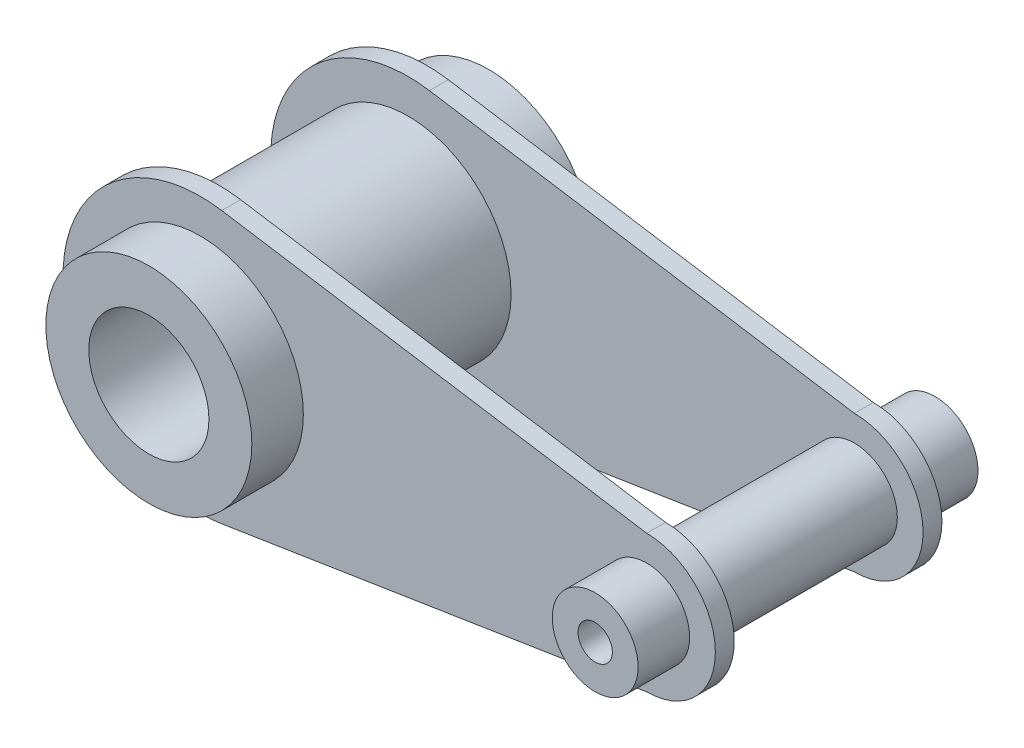
ISO-10303-21;
HEADER;
FILE_DESCRIPTION(('STEP AP214'),'2;1');
FILE_NAME('part.step','',(''),(''),'','','');
FILE_SCHEMA(('AUTOMOTIVE_DESIGN { 1 0 10303 214 1 1 1 1 }'));
ENDSEC;
DATA;
#1=APPLICATION_CONTEXT('core data for automotive mechanical design processes');
#2=APPLICATION_PROTOCOL_DEFINITION('international standard','automotive_design',2000,#1);
#3=PRODUCT_CONTEXT('',#1,'mechanical');
#4=PRODUCT('Part','Part','',(#3));
#5=PRODUCT_RELATED_PRODUCT_CATEGORY('part','',(#4));
#6=PRODUCT_DEFINITION_FORMATION('','',#4);
#7=PRODUCT_DEFINITION_CONTEXT('part definition',#1,'design');
#8=PRODUCT_DEFINITION('design','',#6,#7);
#9=PRODUCT_DEFINITION_SHAPE('','',#8);
#10=(LENGTH_UNIT() NAMED_UNIT(*) SI_UNIT(.MILLI.,.METRE.));
#11=(NAMED_UNIT(*) PLANE_ANGLE_UNIT() SI_UNIT($,.RADIAN.));
#12=(NAMED_UNIT(*) SI_UNIT($,.STERADIAN.) SOLID_ANGLE_UNIT());
#13=UNCERTAINTY_MEASURE_WITH_UNIT(LENGTH_MEASURE(1.E-05),#10,'distance_accuracy_value','');
#14=(GEOMETRIC_REPRESENTATION_CONTEXT(3) GLOBAL_UNCERTAINTY_ASSIGNED_CONTEXT((#13)) GLOBAL_UNIT_ASSIGNED_CONTEXT((#10,
#11,#12)) REPRESENTATION_CONTEXT('',''));
#15=CARTESIAN_POINT('',(0.,0.,0.));
#16=DIRECTION('',(0.,0.,1.));
#17=DIRECTION('',(1.,0.,0.));
#18=AXIS2_PLACEMENT_3D('',#15,#16,#17);
#19=CARTESIAN_POINT('',(0.,0.,-78.5));
#20=DIRECTION('',(0.,0.,1.));
#21=DIRECTION('',(1.,0.,0.));
#22=AXIS2_PLACEMENT_3D('',#19,#20,#21);
#23=CYLINDRICAL_SURFACE('',#22,30.);
#24=CARTESIAN_POINT('',(0.,0.,0.));
#25=DIRECTION('',(0.,0.,1.));
#26=DIRECTION('',(1.,0.,0.));
#27=AXIS2_PLACEMENT_3D('',#24,#25,#26);
#28=CIRCLE('',#27,30.);
#29=CARTESIAN_POINT('',(30.,0.,0.));
#30=VERTEX_POINT('',#29);
#31=EDGE_CURVE('E187',#30,#30,#28,.T.);
#32=ORIENTED_EDGE('',*,*,#31,.F.);
#33=EDGE_LOOP('',(#32));
#34=FACE_BOUND('',#33,.T.);
#35=CARTESIAN_POINT('',(0.,0.,-55.));
#36=DIRECTION('',(0.,0.,-1.));
#37=DIRECTION('',(-1.,0.,0.));
#38=AXIS2_PLACEMENT_3D('',#35,#36,#37);
#39=CIRCLE('',#38,30.);
#40=CARTESIAN_POINT('',(-30.,0.,-55.));
#41=VERTEX_POINT('',#40);
#42=EDGE_CURVE('E156',#41,#41,#39,.F.);
#43=ORIENTED_EDGE('',*,*,#42,.T.);
#44=EDGE_LOOP('',(#43));
#45=FACE_BOUND('',#44,.T.);
#46=ADVANCED_FACE('F33',(#34,#45),#23,.T.);
#47=CARTESIAN_POINT('',(130.,0.,-78.5));
#48=DIRECTION('',(0.,0.,1.));
#49=DIRECTION('',(1.,0.,0.));
#50=AXIS2_PLACEMENT_3D('',#47,#48,#49);
#51=CYLINDRICAL_SURFACE('',#50,12.5);
#52=CARTESIAN_POINT('',(130.,0.,0.));
#53=DIRECTION('',(0.,0.,1.));
#54=DIRECTION('',(1.,0.,0.));
#55=AXIS2_PLACEMENT_3D('',#52,#53,#54);
#56=CIRCLE('',#55,12.5);
#57=CARTESIAN_POINT('',(142.5,0.,0.));
#58=VERTEX_POINT('',#57);
#59=EDGE_CURVE('E37',#58,#58,#56,.T.);
#60=ORIENTED_EDGE('',*,*,#59,.F.);
#61=EDGE_LOOP('',(#60));
#62=FACE_BOUND('',#61,.T.);
#63=CARTESIAN_POINT('',(130.,0.,-55.));
#64=DIRECTION('',(0.,0.,-1.));
#65=DIRECTION('',(-1.,0.,0.));
#66=AXIS2_PLACEMENT_3D('',#63,#64,#65);
#67=CIRCLE('',#66,12.5);
#68=CARTESIAN_POINT('',(117.5,0.,-55.));
#69=VERTEX_POINT('',#68);
#70=EDGE_CURVE('E122',#69,#69,#67,.F.);
#71=ORIENTED_EDGE('',*,*,#70,.T.);
#72=EDGE_LOOP('',(#71));
#73=FACE_BOUND('',#72,.T.);
#74=ADVANCED_FACE('F220',(#62,#73),#51,.T.);
#75=CARTESIAN_POINT('',(130.,0.,5.5));
#76=DIRECTION('',(0.,0.,-1.));
#77=DIRECTION('',(-1.,0.,0.));
#78=AXIS2_PLACEMENT_3D('',#75,#76,#77);
#79=CYLINDRICAL_SURFACE('',#78,20.);
#80=CARTESIAN_POINT('',(130.,0.,0.));
#81=DIRECTION('',(0.,0.,1.));
#82=DIRECTION('',(1.,0.,0.));
#83=AXIS2_PLACEMENT_3D('',#80,#81,#82);
#84=CIRCLE('',#83,20.);
#85=CARTESIAN_POINT('',(130.,-20.,0.));
#86=VERTEX_POINT('',#85);
#87=CARTESIAN_POINT('',(130.,20.,0.));
#88=VERTEX_POINT('',#87);
#89=EDGE_CURVE('E200',#86,#88,#84,.T.);
#90=ORIENTED_EDGE('',*,*,#89,.T.);
#91=DIRECTION('',(0.,0.,-1.));
#92=VECTOR('',#91,1.);
#93=CARTESIAN_POINT('',(130.,20.,5.5));
#94=LINE('',#93,#92);
#95=CARTESIAN_POINT('',(130.,20.,5.5));
#96=VERTEX_POINT('',#95);
#97=EDGE_CURVE('E192',#96,#88,#94,.T.);
#98=ORIENTED_EDGE('',*,*,#97,.F.);
#99=CARTESIAN_POINT('',(130.,0.,5.5));
#100=DIRECTION('',(0.,0.,1.));
#101=DIRECTION('',(1.,0.,0.));
#102=AXIS2_PLACEMENT_3D('',#99,#100,#101);
#103=CIRCLE('',#102,20.);
#104=CARTESIAN_POINT('',(130.,-20.,5.5));
#105=VERTEX_POINT('',#104);
#106=EDGE_CURVE('E193',#105,#96,#103,.T.);
#107=ORIENTED_EDGE('',*,*,#106,.F.);
#108=DIRECTION('',(0.,0.,-1.));
#109=VECTOR('',#108,1.);
#110=CARTESIAN_POINT('',(130.,-20.,5.5));
#111=LINE('',#110,#109);
#112=EDGE_CURVE('E199',#105,#86,#111,.T.);
#113=ORIENTED_EDGE('',*,*,#112,.T.);
#114=EDGE_LOOP('',(#90,#98,#107,#113));
#115=FACE_BOUND('',#114,.T.);
#116=ADVANCED_FACE('F35',(#115),#79,.T.);
#117=CARTESIAN_POINT('',(6.2289183416686,39.5120307791541,5.5));
#118=DIRECTION('',(-0.155722958541715,-0.987800769478854,0.));
#119=DIRECTION('',(0.987800769478854,-0.155722958541715,0.));
#120=AXIS2_PLACEMENT_3D('',#117,#118,#119);
#121=PLANE('',#120);
#122=DIRECTION('',(-0.987800769478854,0.155722958541715,0.));
#123=VECTOR('',#122,1.);
#124=CARTESIAN_POINT('',(6.2289183416686,39.5120307791541,0.));
#125=LINE('',#124,#123);
#126=CARTESIAN_POINT('',(6.2289183416686,39.5120307791541,0.));
#127=VERTEX_POINT('',#126);
#128=EDGE_CURVE('E203',#88,#127,#125,.T.);
#129=ORIENTED_EDGE('',*,*,#128,.T.);
#130=DIRECTION('',(0.,0.,-1.));
#131=VECTOR('',#130,1.);
#132=CARTESIAN_POINT('',(6.2289183416686,39.5120307791541,5.5));
#133=LINE('',#132,#131);
#134=CARTESIAN_POINT('',(6.2289183416686,39.5120307791541,5.5));
#135=VERTEX_POINT('',#134);
#136=EDGE_CURVE('E210',#135,#127,#133,.T.);
#137=ORIENTED_EDGE('',*,*,#136,.F.);
#138=DIRECTION('',(-0.987800769478854,0.155722958541715,0.));
#139=VECTOR('',#138,1.);
#140=CARTESIAN_POINT('',(6.2289183416686,39.5120307791541,5.5));
#141=LINE('',#140,#139);
#142=EDGE_CURVE('E84',#96,#135,#141,.T.);
#143=ORIENTED_EDGE('',*,*,#142,.F.);
#144=ORIENTED_EDGE('',*,*,#97,.T.);
#145=EDGE_LOOP('',(#129,#137,#143,#144));
#146=FACE_BOUND('',#145,.T.);
#147=ADVANCED_FACE('F292',(#146),#121,.F.);
#148=CARTESIAN_POINT('',(0.,0.,5.5));
#149=DIRECTION('',(0.,0.,-1.));
#150=DIRECTION('',(-1.,0.,0.));
#151=AXIS2_PLACEMENT_3D('',#148,#149,#150);
#152=CYLINDRICAL_SURFACE('',#151,40.);
#153=CARTESIAN_POINT('',(0.,0.,0.));
#154=DIRECTION('',(0.,0.,1.));
#155=DIRECTION('',(1.,0.,0.));
#156=AXIS2_PLACEMENT_3D('',#153,#154,#155);
#157=CIRCLE('',#156,40.);
#158=CARTESIAN_POINT('',(6.2289183416686,-39.5120307791541,0.));
#159=VERTEX_POINT('',#158);
#160=EDGE_CURVE('E70',#127,#159,#157,.T.);
#161=ORIENTED_EDGE('',*,*,#160,.T.);
#162=DIRECTION('',(0.,0.,-1.));
#163=VECTOR('',#162,1.);
#164=CARTESIAN_POINT('',(6.2289183416686,-39.5120307791541,5.5));
#165=LINE('',#164,#163);
#166=CARTESIAN_POINT('',(6.2289183416686,-39.5120307791541,5.5));
#167=VERTEX_POINT('',#166);
#168=EDGE_CURVE('E208',#167,#159,#165,.T.);
#169=ORIENTED_EDGE('',*,*,#168,.F.);
#170=CARTESIAN_POINT('',(0.,0.,5.5));
#171=DIRECTION('',(0.,0.,1.));
#172=DIRECTION('',(1.,0.,0.));
#173=AXIS2_PLACEMENT_3D('',#170,#171,#172);
#174=CIRCLE('',#173,40.);
#175=EDGE_CURVE('E196',#135,#167,#174,.T.);
#176=ORIENTED_EDGE('',*,*,#175,.F.);
#177=ORIENTED_EDGE('',*,*,#136,.T.);
#178=EDGE_LOOP('',(#161,#169,#176,#177));
#179=FACE_BOUND('',#178,.T.);
#180=ADVANCED_FACE('F290',(#179),#152,.T.);
#181=CARTESIAN_POINT('',(6.2289183416686,-39.5120307791541,5.5));
#182=DIRECTION('',(-0.155722958541715,0.987800769478854,0.));
#183=DIRECTION('',(-0.987800769478854,-0.155722958541715,0.));
#184=AXIS2_PLACEMENT_3D('',#181,#182,#183);
#185=PLANE('',#184);
#186=DIRECTION('',(0.987800769478854,0.155722958541715,0.));
#187=VECTOR('',#186,1.);
#188=CARTESIAN_POINT('',(6.2289183416686,-39.5120307791541,0.));
#189=LINE('',#188,#187);
#190=EDGE_CURVE('E76',#159,#86,#189,.T.);
#191=ORIENTED_EDGE('',*,*,#190,.T.);
#192=ORIENTED_EDGE('',*,*,#112,.F.);
#193=DIRECTION('',(0.987800769478854,0.155722958541715,0.));
#194=VECTOR('',#193,1.);
#195=CARTESIAN_POINT('',(6.2289183416686,-39.5120307791541,5.5));
#196=LINE('',#195,#194);
#197=EDGE_CURVE('E52',#167,#105,#196,.T.);
#198=ORIENTED_EDGE('',*,*,#197,.F.);
#199=ORIENTED_EDGE('',*,*,#168,.T.);
#200=EDGE_LOOP('',(#191,#192,#198,#199));
#201=FACE_BOUND('',#200,.T.);
#202=ADVANCED_FACE('F283',(#201),#185,.F.);
#203=CARTESIAN_POINT('',(130.,0.,5.5));
#204=DIRECTION('',(0.,0.,1.));
#205=DIRECTION('',(1.,0.,0.));
#206=AXIS2_PLACEMENT_3D('',#203,#204,#205);
#207=PLANE('',#206);
#208=CARTESIAN_POINT('',(130.,0.,5.50000000000001));
#209=DIRECTION('',(0.,0.,1.));
#210=DIRECTION('',(1.,0.,0.));
#211=AXIS2_PLACEMENT_3D('',#208,#209,#210);
#212=CIRCLE('',#211,12.5);
#213=CARTESIAN_POINT('',(142.5,0.,5.50000000000001));
#214=VERTEX_POINT('',#213);
#215=EDGE_CURVE('E161',#214,#214,#212,.T.);
#216=ORIENTED_EDGE('',*,*,#215,.F.);
#217=EDGE_LOOP('',(#216));
#218=FACE_BOUND('',#217,.T.);
#219=CARTESIAN_POINT('',(0.,0.,5.50000000000001));
#220=DIRECTION('',(0.,0.,1.));
#221=DIRECTION('',(1.,0.,0.));
#222=AXIS2_PLACEMENT_3D('',#219,#220,#221);
#223=CIRCLE('',#222,30.);
#224=CARTESIAN_POINT('',(30.,0.,5.50000000000001));
#225=VERTEX_POINT('',#224);
#226=EDGE_CURVE('E176',#225,#225,#223,.T.);
#227=ORIENTED_EDGE('',*,*,#226,.F.);
#228=EDGE_LOOP('',(#227));
#229=FACE_BOUND('',#228,.T.);
#230=ORIENTED_EDGE('',*,*,#106,.T.);
#231=ORIENTED_EDGE('',*,*,#142,.T.);
#232=ORIENTED_EDGE('',*,*,#175,.T.);
#233=ORIENTED_EDGE('',*,*,#197,.T.);
#234=EDGE_LOOP('',(#230,#231,#232,#233));
#235=FACE_BOUND('',#234,.T.);
#236=ADVANCED_FACE('F280',(#218,#229,#235),#207,.T.);
#237=CARTESIAN_POINT('',(130.,0.,0.));
#238=DIRECTION('',(0.,0.,1.));
#239=DIRECTION('',(1.,0.,0.));
#240=AXIS2_PLACEMENT_3D('',#237,#238,#239);
#241=PLANE('',#240);
#242=ORIENTED_EDGE('',*,*,#59,.T.);
#243=EDGE_LOOP('',(#242));
#244=FACE_BOUND('',#243,.T.);
#245=ORIENTED_EDGE('',*,*,#31,.T.);
#246=EDGE_LOOP('',(#245));
#247=FACE_BOUND('',#246,.T.);
#248=ORIENTED_EDGE('',*,*,#89,.F.);
#249=ORIENTED_EDGE('',*,*,#190,.F.);
#250=ORIENTED_EDGE('',*,*,#160,.F.);
#251=ORIENTED_EDGE('',*,*,#128,.F.);
#252=EDGE_LOOP('',(#248,#249,#250,#251));
#253=FACE_BOUND('',#252,.T.);
#254=ADVANCED_FACE('F215',(#244,#247,#253),#241,.F.);
#255=ORIENTED_EDGE('',*,*,#226,.T.);
#256=EDGE_LOOP('',(#255));
#257=FACE_BOUND('',#256,.T.);
#258=CARTESIAN_POINT('',(0.,0.,20.5));
#259=DIRECTION('',(0.,0.,1.));
#260=DIRECTION('',(1.,0.,0.));
#261=AXIS2_PLACEMENT_3D('',#258,#259,#260);
#262=CIRCLE('',#261,30.);
#263=CARTESIAN_POINT('',(30.,0.,20.5));
#264=VERTEX_POINT('',#263);
#265=EDGE_CURVE('E180',#264,#264,#262,.T.);
#266=ORIENTED_EDGE('',*,*,#265,.F.);
#267=EDGE_LOOP('',(#266));
#268=FACE_BOUND('',#267,.T.);
#269=ADVANCED_FACE('F223',(#257,#268),#23,.T.);
#270=CARTESIAN_POINT('',(0.,0.,20.5));
#271=DIRECTION('',(0.,0.,1.));
#272=DIRECTION('',(1.,0.,0.));
#273=AXIS2_PLACEMENT_3D('',#270,#271,#272);
#274=PLANE('',#273);
#275=CARTESIAN_POINT('',(0.,0.,20.5));
#276=DIRECTION('',(0.,0.,1.));
#277=DIRECTION('',(1.,0.,0.));
#278=AXIS2_PLACEMENT_3D('',#275,#276,#277);
#279=CIRCLE('',#278,17.5);
#280=CARTESIAN_POINT('',(17.5,0.,20.5));
#281=VERTEX_POINT('',#280);
#282=EDGE_CURVE('E181',#281,#281,#279,.T.);
#283=ORIENTED_EDGE('',*,*,#282,.F.);
#284=EDGE_LOOP('',(#283));
#285=FACE_BOUND('',#284,.T.);
#286=ORIENTED_EDGE('',*,*,#265,.T.);
#287=EDGE_LOOP('',(#286));
#288=FACE_BOUND('',#287,.T.);
#289=ADVANCED_FACE('F265',(#285,#288),#274,.T.);
#290=ORIENTED_EDGE('',*,*,#215,.T.);
#291=EDGE_LOOP('',(#290));
#292=FACE_BOUND('',#291,.T.);
#293=CARTESIAN_POINT('',(130.,0.,20.5));
#294=DIRECTION('',(0.,0.,1.));
#295=DIRECTION('',(1.,0.,0.));
#296=AXIS2_PLACEMENT_3D('',#293,#294,#295);
#297=CIRCLE('',#296,12.5);
#298=CARTESIAN_POINT('',(142.5,0.,20.5));
#299=VERTEX_POINT('',#298);
#300=EDGE_CURVE('E166',#299,#299,#297,.T.);
#301=ORIENTED_EDGE('',*,*,#300,.F.);
#302=EDGE_LOOP('',(#301));
#303=FACE_BOUND('',#302,.T.);
#304=ADVANCED_FACE('F261',(#292,#303),#51,.T.);
#305=CARTESIAN_POINT('',(130.,0.,20.5));
#306=DIRECTION('',(0.,0.,1.));
#307=DIRECTION('',(1.,0.,0.));
#308=AXIS2_PLACEMENT_3D('',#305,#306,#307);
#309=PLANE('',#308);
#310=CARTESIAN_POINT('',(130.,0.,20.5));
#311=DIRECTION('',(0.,0.,1.));
#312=DIRECTION('',(1.,0.,0.));
#313=AXIS2_PLACEMENT_3D('',#310,#311,#312);
#314=CIRCLE('',#313,4.99999999999999);
#315=CARTESIAN_POINT('',(135.,0.,20.5));
#316=VERTEX_POINT('',#315);
#317=EDGE_CURVE('E159',#316,#316,#314,.T.);
#318=ORIENTED_EDGE('',*,*,#317,.F.);
#319=EDGE_LOOP('',(#318));
#320=FACE_BOUND('',#319,.T.);
#321=ORIENTED_EDGE('',*,*,#300,.T.);
#322=EDGE_LOOP('',(#321));
#323=FACE_BOUND('',#322,.T.);
#324=ADVANCED_FACE('F229',(#320,#323),#309,.T.);
#325=CARTESIAN_POINT('',(130.,0.,-55.));
#326=DIRECTION('',(0.,0.,-1.));
#327=DIRECTION('',(1.,0.,0.));
#328=AXIS2_PLACEMENT_3D('',#325,#326,#327);
#329=PLANE('',#328);
#330=ORIENTED_EDGE('',*,*,#42,.F.);
#331=EDGE_LOOP('',(#330));
#332=FACE_BOUND('',#331,.T.);
#333=ORIENTED_EDGE('',*,*,#70,.F.);
#334=EDGE_LOOP('',(#333));
#335=FACE_BOUND('',#334,.T.);
#336=CARTESIAN_POINT('',(130.,0.,-55.));
#337=DIRECTION('',(0.,0.,1.));
#338=DIRECTION('',(1.,0.,0.));
#339=AXIS2_PLACEMENT_3D('',#336,#337,#338);
#340=CIRCLE('',#339,20.);
#341=CARTESIAN_POINT('',(130.,-20.,-55.));
#342=VERTEX_POINT('',#341);
#343=CARTESIAN_POINT('',(130.,20.,-55.));
#344=VERTEX_POINT('',#343);
#345=EDGE_CURVE('E117',#342,#344,#340,.T.);
#346=ORIENTED_EDGE('',*,*,#345,.T.);
#347=DIRECTION('',(-0.987800769478854,0.155722958541715,0.));
#348=VECTOR('',#347,1.);
#349=CARTESIAN_POINT('',(6.2289183416686,39.5120307791541,-55.));
#350=LINE('',#349,#348);
#351=CARTESIAN_POINT('',(6.2289183416686,39.5120307791541,-55.));
#352=VERTEX_POINT('',#351);
#353=EDGE_CURVE('E133',#344,#352,#350,.T.);
#354=ORIENTED_EDGE('',*,*,#353,.T.);
#355=CARTESIAN_POINT('',(0.,0.,-55.));
#356=DIRECTION('',(0.,0.,1.));
#357=DIRECTION('',(1.,0.,0.));
#358=AXIS2_PLACEMENT_3D('',#355,#356,#357);
#359=CIRCLE('',#358,40.);
#360=CARTESIAN_POINT('',(6.2289183416686,-39.5120307791541,-55.));
#361=VERTEX_POINT('',#360);
#362=EDGE_CURVE('E145',#352,#361,#359,.T.);
#363=ORIENTED_EDGE('',*,*,#362,.T.);
#364=DIRECTION('',(0.987800769478854,0.155722958541715,0.));
#365=VECTOR('',#364,1.);
#366=CARTESIAN_POINT('',(6.2289183416686,-39.5120307791541,-55.));
#367=LINE('',#366,#365);
#368=EDGE_CURVE('E143',#361,#342,#367,.T.);
#369=ORIENTED_EDGE('',*,*,#368,.T.);
#370=EDGE_LOOP('',(#346,#354,#363,#369));
#371=FACE_BOUND('',#370,.T.);
#372=ADVANCED_FACE('F226',(#332,#335,#371),#329,.F.);
#373=CARTESIAN_POINT('',(130.,0.,-60.5));
#374=DIRECTION('',(0.,0.,-1.));
#375=DIRECTION('',(1.,0.,0.));
#376=AXIS2_PLACEMENT_3D('',#373,#374,#375);
#377=PLANE('',#376);
#378=CARTESIAN_POINT('',(0.,0.,-60.5));
#379=DIRECTION('',(0.,0.,-1.));
#380=DIRECTION('',(-1.,0.,0.));
#381=AXIS2_PLACEMENT_3D('',#378,#379,#380);
#382=CIRCLE('',#381,30.);
#383=CARTESIAN_POINT('',(-30.,0.,-60.5));
#384=VERTEX_POINT('',#383);
#385=EDGE_CURVE('E11',#384,#384,#382,.F.);
#386=ORIENTED_EDGE('',*,*,#385,.T.);
#387=EDGE_LOOP('',(#386));
#388=FACE_BOUND('',#387,.T.);
#389=CARTESIAN_POINT('',(130.,0.,-60.5));
#390=DIRECTION('',(0.,0.,-1.));
#391=DIRECTION('',(-1.,0.,0.));
#392=AXIS2_PLACEMENT_3D('',#389,#390,#391);
#393=CIRCLE('',#392,12.5);
#394=CARTESIAN_POINT('',(117.5,0.,-60.5));
#395=VERTEX_POINT('',#394);
#396=EDGE_CURVE('E43',#395,#395,#393,.F.);
#397=ORIENTED_EDGE('',*,*,#396,.T.);
#398=EDGE_LOOP('',(#397));
#399=FACE_BOUND('',#398,.T.);
#400=CARTESIAN_POINT('',(130.,0.,-60.5));
#401=DIRECTION('',(0.,0.,1.));
#402=DIRECTION('',(1.,0.,0.));
#403=AXIS2_PLACEMENT_3D('',#400,#401,#402);
#404=CIRCLE('',#403,20.);
#405=CARTESIAN_POINT('',(130.,-20.,-60.5));
#406=VERTEX_POINT('',#405);
#407=CARTESIAN_POINT('',(130.,20.,-60.5));
#408=VERTEX_POINT('',#407);
#409=EDGE_CURVE('E114',#406,#408,#404,.T.);
#410=ORIENTED_EDGE('',*,*,#409,.F.);
#411=DIRECTION('',(0.987800769478854,0.155722958541715,0.));
#412=VECTOR('',#411,1.);
#413=CARTESIAN_POINT('',(6.2289183416686,-39.5120307791541,-60.5));
#414=LINE('',#413,#412);
#415=CARTESIAN_POINT('',(6.2289183416686,-39.5120307791541,-60.5));
#416=VERTEX_POINT('',#415);
#417=EDGE_CURVE('E129',#416,#406,#414,.T.);
#418=ORIENTED_EDGE('',*,*,#417,.F.);
#419=CARTESIAN_POINT('',(0.,0.,-60.5));
#420=DIRECTION('',(0.,0.,1.));
#421=DIRECTION('',(1.,0.,0.));
#422=AXIS2_PLACEMENT_3D('',#419,#420,#421);
#423=CIRCLE('',#422,40.);
#424=CARTESIAN_POINT('',(6.2289183416686,39.5120307791541,-60.5));
#425=VERTEX_POINT('',#424);
#426=EDGE_CURVE('E136',#425,#416,#423,.T.);
#427=ORIENTED_EDGE('',*,*,#426,.F.);
#428=DIRECTION('',(-0.987800769478854,0.155722958541715,0.));
#429=VECTOR('',#428,1.);
#430=CARTESIAN_POINT('',(6.2289183416686,39.5120307791541,-60.5));
#431=LINE('',#430,#429);
#432=EDGE_CURVE('E132',#408,#425,#431,.T.);
#433=ORIENTED_EDGE('',*,*,#432,.F.);
#434=EDGE_LOOP('',(#410,#418,#427,#433));
#435=FACE_BOUND('',#434,.T.);
#436=ADVANCED_FACE('F127',(#388,#399,#435),#377,.T.);
#437=CARTESIAN_POINT('',(6.2289183416686,39.5120307791541,-60.5));
#438=DIRECTION('',(0.155722958541715,0.987800769478854,0.));
#439=DIRECTION('',(-0.987800769478854,0.155722958541715,0.));
#440=AXIS2_PLACEMENT_3D('',#437,#438,#439);
#441=PLANE('',#440);
#442=ORIENTED_EDGE('',*,*,#353,.F.);
#443=DIRECTION('',(0.,0.,1.));
#444=VECTOR('',#443,1.);
#445=CARTESIAN_POINT('',(130.,20.,-60.5));
#446=LINE('',#445,#444);
#447=EDGE_CURVE('E141',#408,#344,#446,.T.);
#448=ORIENTED_EDGE('',*,*,#447,.F.);
#449=ORIENTED_EDGE('',*,*,#432,.T.);
#450=DIRECTION('',(0.,0.,1.));
#451=VECTOR('',#450,1.);
#452=CARTESIAN_POINT('',(6.2289183416686,39.5120307791541,-60.5));
#453=LINE('',#452,#451);
#454=EDGE_CURVE('E151',#425,#352,#453,.T.);
#455=ORIENTED_EDGE('',*,*,#454,.T.);
#456=EDGE_LOOP('',(#442,#448,#449,#455));
#457=FACE_BOUND('',#456,.T.);
#458=ADVANCED_FACE('F235',(#457),#441,.T.);
#459=CARTESIAN_POINT('',(0.,0.,-60.5));
#460=DIRECTION('',(0.,0.,1.));
#461=DIRECTION('',(1.,0.,0.));
#462=AXIS2_PLACEMENT_3D('',#459,#460,#461);
#463=CYLINDRICAL_SURFACE('',#462,40.);
#464=ORIENTED_EDGE('',*,*,#362,.F.);
#465=ORIENTED_EDGE('',*,*,#454,.F.);
#466=ORIENTED_EDGE('',*,*,#426,.T.);
#467=DIRECTION('',(0.,0.,1.));
#468=VECTOR('',#467,1.);
#469=CARTESIAN_POINT('',(6.2289183416686,-39.5120307791541,-60.5));
#470=LINE('',#469,#468);
#471=EDGE_CURVE('E123',#416,#361,#470,.T.);
#472=ORIENTED_EDGE('',*,*,#471,.T.);
#473=EDGE_LOOP('',(#464,#465,#466,#472));
#474=FACE_BOUND('',#473,.T.);
#475=ADVANCED_FACE('F238',(#474),#463,.T.);
#476=CARTESIAN_POINT('',(6.2289183416686,-39.5120307791541,-60.5));
#477=DIRECTION('',(0.155722958541715,-0.987800769478854,0.));
#478=DIRECTION('',(0.987800769478854,0.155722958541715,0.));
#479=AXIS2_PLACEMENT_3D('',#476,#477,#478);
#480=PLANE('',#479);
#481=ORIENTED_EDGE('',*,*,#368,.F.);
#482=ORIENTED_EDGE('',*,*,#471,.F.);
#483=ORIENTED_EDGE('',*,*,#417,.T.);
#484=DIRECTION('',(0.,0.,1.));
#485=VECTOR('',#484,1.);
#486=CARTESIAN_POINT('',(130.,-20.,-60.5));
#487=LINE('',#486,#485);
#488=EDGE_CURVE('E111',#406,#342,#487,.T.);
#489=ORIENTED_EDGE('',*,*,#488,.T.);
#490=EDGE_LOOP('',(#481,#482,#483,#489));
#491=FACE_BOUND('',#490,.T.);
#492=ADVANCED_FACE('F135',(#491),#480,.T.);
#493=CARTESIAN_POINT('',(130.,0.,-60.5));
#494=DIRECTION('',(0.,0.,1.));
#495=DIRECTION('',(1.,0.,0.));
#496=AXIS2_PLACEMENT_3D('',#493,#494,#495);
#497=CYLINDRICAL_SURFACE('',#496,20.);
#498=ORIENTED_EDGE('',*,*,#345,.F.);
#499=ORIENTED_EDGE('',*,*,#488,.F.);
#500=ORIENTED_EDGE('',*,*,#409,.T.);
#501=ORIENTED_EDGE('',*,*,#447,.T.);
#502=EDGE_LOOP('',(#498,#499,#500,#501));
#503=FACE_BOUND('',#502,.T.);
#504=ADVANCED_FACE('F113',(#503),#497,.T.);
#505=ORIENTED_EDGE('',*,*,#385,.F.);
#506=EDGE_LOOP('',(#505));
#507=FACE_BOUND('',#506,.T.);
#508=CARTESIAN_POINT('',(0.,0.,-78.5));
#509=DIRECTION('',(0.,0.,1.));
#510=DIRECTION('',(1.,0.,0.));
#511=AXIS2_PLACEMENT_3D('',#508,#509,#510);
#512=CIRCLE('',#511,30.);
#513=CARTESIAN_POINT('',(30.,0.,-78.5));
#514=VERTEX_POINT('',#513);
#515=EDGE_CURVE('E184',#514,#514,#512,.T.);
#516=ORIENTED_EDGE('',*,*,#515,.T.);
#517=EDGE_LOOP('',(#516));
#518=FACE_BOUND('',#517,.T.);
#519=ADVANCED_FACE('F222',(#507,#518),#23,.T.);
#520=CARTESIAN_POINT('',(0.,0.,-78.5));
#521=DIRECTION('',(0.,0.,1.));
#522=DIRECTION('',(1.,0.,0.));
#523=AXIS2_PLACEMENT_3D('',#520,#521,#522);
#524=PLANE('',#523);
#525=CARTESIAN_POINT('',(0.,0.,-78.5));
#526=DIRECTION('',(0.,0.,1.));
#527=DIRECTION('',(1.,0.,0.));
#528=AXIS2_PLACEMENT_3D('',#525,#526,#527);
#529=CIRCLE('',#528,17.5);
#530=CARTESIAN_POINT('',(17.5,0.,-78.5));
#531=VERTEX_POINT('',#530);
#532=EDGE_CURVE('E177',#531,#531,#529,.T.);
#533=ORIENTED_EDGE('',*,*,#532,.T.);
#534=EDGE_LOOP('',(#533));
#535=FACE_BOUND('',#534,.T.);
#536=ORIENTED_EDGE('',*,*,#515,.F.);
#537=EDGE_LOOP('',(#536));
#538=FACE_BOUND('',#537,.T.);
#539=ADVANCED_FACE('F270',(#535,#538),#524,.F.);
#540=CARTESIAN_POINT('',(0.,0.,-78.5));
#541=DIRECTION('',(0.,0.,1.));
#542=DIRECTION('',(1.,0.,0.));
#543=AXIS2_PLACEMENT_3D('',#540,#541,#542);
#544=CYLINDRICAL_SURFACE('',#543,17.5);
#545=ORIENTED_EDGE('',*,*,#532,.F.);
#546=EDGE_LOOP('',(#545));
#547=FACE_BOUND('',#546,.T.);
#548=ORIENTED_EDGE('',*,*,#282,.T.);
#549=EDGE_LOOP('',(#548));
#550=FACE_BOUND('',#549,.T.);
#551=ADVANCED_FACE('F267',(#547,#550),#544,.F.);
#552=ORIENTED_EDGE('',*,*,#396,.F.);
#553=EDGE_LOOP('',(#552));
#554=FACE_BOUND('',#553,.T.);
#555=CARTESIAN_POINT('',(130.,0.,-78.5));
#556=DIRECTION('',(0.,0.,1.));
#557=DIRECTION('',(1.,0.,0.));
#558=AXIS2_PLACEMENT_3D('',#555,#556,#557);
#559=CIRCLE('',#558,12.5);
#560=CARTESIAN_POINT('',(142.5,0.,-78.5));
#561=VERTEX_POINT('',#560);
#562=EDGE_CURVE('E169',#561,#561,#559,.T.);
#563=ORIENTED_EDGE('',*,*,#562,.T.);
#564=EDGE_LOOP('',(#563));
#565=FACE_BOUND('',#564,.T.);
#566=ADVANCED_FACE('F257',(#554,#565),#51,.T.);
#567=CARTESIAN_POINT('',(130.,0.,-78.5));
#568=DIRECTION('',(0.,0.,1.));
#569=DIRECTION('',(1.,0.,0.));
#570=AXIS2_PLACEMENT_3D('',#567,#568,#569);
#571=PLANE('',#570);
#572=CARTESIAN_POINT('',(130.,0.,-78.5));
#573=DIRECTION('',(0.,0.,1.));
#574=DIRECTION('',(1.,0.,0.));
#575=AXIS2_PLACEMENT_3D('',#572,#573,#574);
#576=CIRCLE('',#575,4.99999999999999);
#577=CARTESIAN_POINT('',(135.,0.,-78.5));
#578=VERTEX_POINT('',#577);
#579=EDGE_CURVE('E163',#578,#578,#576,.T.);
#580=ORIENTED_EDGE('',*,*,#579,.T.);
#581=EDGE_LOOP('',(#580));
#582=FACE_BOUND('',#581,.T.);
#583=ORIENTED_EDGE('',*,*,#562,.F.);
#584=EDGE_LOOP('',(#583));
#585=FACE_BOUND('',#584,.T.);
#586=ADVANCED_FACE('F253',(#582,#585),#571,.F.);
#587=CARTESIAN_POINT('',(130.,0.,-78.5));
#588=DIRECTION('',(0.,0.,1.));
#589=DIRECTION('',(1.,0.,0.));
#590=AXIS2_PLACEMENT_3D('',#587,#588,#589);
#591=CYLINDRICAL_SURFACE('',#590,4.99999999999999);
#592=ORIENTED_EDGE('',*,*,#579,.F.);
#593=EDGE_LOOP('',(#592));
#594=FACE_BOUND('',#593,.T.);
#595=ORIENTED_EDGE('',*,*,#317,.T.);
#596=EDGE_LOOP('',(#595));
#597=FACE_BOUND('',#596,.T.);
#598=ADVANCED_FACE('F250',(#594,#597),#591,.F.);
#599=CLOSED_SHELL('',(#46,#74,#116,#147,#180,#202,#236,#254,#269,#289,#304,#324,#372,#436,#458,
#475,#492,#504,#519,#539,#551,#566,#586,#598));
#600=MANIFOLD_SOLID_BREP('B2',#599);
#601=ADVANCED_BREP_SHAPE_REPRESENTATION('',(#18,#600),#14);
#602=SHAPE_DEFINITION_REPRESENTATION(#9,#601);
ENDSEC;
END-ISO-10303-21;
